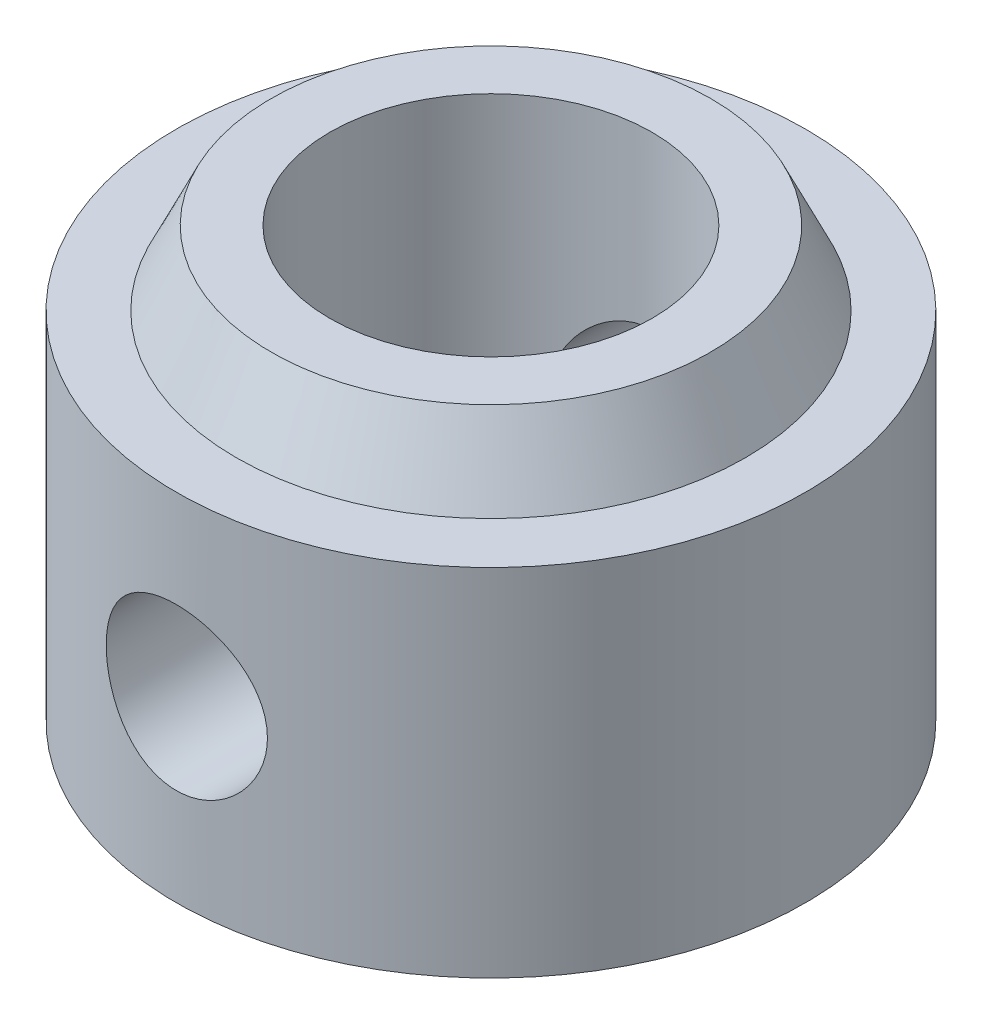
ISO-10303-21;
HEADER;
FILE_DESCRIPTION(('STEP AP214'),'2;1');
FILE_NAME('part.step','',(''),(''),'','','');
FILE_SCHEMA(('AUTOMOTIVE_DESIGN { 1 0 10303 214 1 1 1 1 }'));
ENDSEC;
DATA;
#1=APPLICATION_CONTEXT('core data for automotive mechanical design processes');
#2=APPLICATION_PROTOCOL_DEFINITION('international standard','automotive_design',2000,#1);
#3=PRODUCT_CONTEXT('',#1,'mechanical');
#4=PRODUCT('Part','Part','',(#3));
#5=PRODUCT_RELATED_PRODUCT_CATEGORY('part','',(#4));
#6=PRODUCT_DEFINITION_FORMATION('','',#4);
#7=PRODUCT_DEFINITION_CONTEXT('part definition',#1,'design');
#8=PRODUCT_DEFINITION('design','',#6,#7);
#9=PRODUCT_DEFINITION_SHAPE('','',#8);
#10=(LENGTH_UNIT() NAMED_UNIT(*) SI_UNIT(.MILLI.,.METRE.));
#11=(NAMED_UNIT(*) PLANE_ANGLE_UNIT() SI_UNIT($,.RADIAN.));
#12=(NAMED_UNIT(*) SI_UNIT($,.STERADIAN.) SOLID_ANGLE_UNIT());
#13=UNCERTAINTY_MEASURE_WITH_UNIT(LENGTH_MEASURE(1.E-05),#10,'distance_accuracy_value','');
#14=(GEOMETRIC_REPRESENTATION_CONTEXT(3) GLOBAL_UNCERTAINTY_ASSIGNED_CONTEXT((#13)) GLOBAL_UNIT_ASSIGNED_CONTEXT((#10,
#11,#12)) REPRESENTATION_CONTEXT('',''));
#15=CARTESIAN_POINT('',(0.,0.,0.));
#16=DIRECTION('',(0.,0.,1.));
#17=DIRECTION('',(1.,0.,0.));
#18=AXIS2_PLACEMENT_3D('',#15,#16,#17);
#19=CARTESIAN_POINT('',(2.794,5.461,0.));
#20=DIRECTION('',(0.,1.,0.));
#21=DIRECTION('',(0.,0.,1.));
#22=AXIS2_PLACEMENT_3D('',#19,#20,#21);
#23=PLANE('',#22);
#24=CARTESIAN_POINT('',(0.,5.461,0.));
#25=DIRECTION('',(0.,-1.,0.));
#26=DIRECTION('',(0.,0.,-1.));
#27=AXIS2_PLACEMENT_3D('',#24,#25,#26);
#28=CIRCLE('',#27,2.05);
#29=CARTESIAN_POINT('',(0.,5.461,-2.05));
#30=VERTEX_POINT('',#29);
#31=EDGE_CURVE('E50',#30,#30,#28,.T.);
#32=ORIENTED_EDGE('',*,*,#31,.T.);
#33=EDGE_LOOP('',(#32));
#34=FACE_BOUND('',#33,.T.);
#35=CARTESIAN_POINT('',(0.,5.461,0.));
#36=DIRECTION('',(0.,-1.,0.));
#37=DIRECTION('',(0.,0.,-1.));
#38=AXIS2_PLACEMENT_3D('',#35,#36,#37);
#39=CIRCLE('',#38,2.794);
#40=CARTESIAN_POINT('',(0.,5.461,-2.794));
#41=VERTEX_POINT('',#40);
#42=EDGE_CURVE('E109',#41,#41,#39,.T.);
#43=ORIENTED_EDGE('',*,*,#42,.F.);
#44=EDGE_LOOP('',(#43));
#45=FACE_BOUND('',#44,.T.);
#46=ADVANCED_FACE('F35',(#34,#45),#23,.T.);
#47=CARTESIAN_POINT('',(0.,0.,0.));
#48=DIRECTION('',(0.,-1.,0.));
#49=DIRECTION('',(0.,0.,-1.));
#50=AXIS2_PLACEMENT_3D('',#47,#48,#49);
#51=CYLINDRICAL_SURFACE('',#50,2.05);
#52=CARTESIAN_POINT('',(0.,3.28559999999999,-2.05));
#53=CARTESIAN_POINT('',(-0.0538862620268108,3.2855966151225,-2.04999706239255));
#54=CARTESIAN_POINT('',(-0.107836764690483,3.28132567505028,-2.04785253295006));
#55=CARTESIAN_POINT('',(-0.214143241150135,3.26443079765055,-2.03948509938331));
#56=CARTESIAN_POINT('',(-0.26649598888134,3.2517909971774,-2.03325445024708));
#57=CARTESIAN_POINT('',(-0.367906883502587,3.21877634616778,-2.01736686388394));
#58=CARTESIAN_POINT('',(-0.416976973012657,3.19843155614578,-2.00772325156958));
#59=CARTESIAN_POINT('',(-0.510934432226727,3.15074011310093,-1.98589420928673));
#60=CARTESIAN_POINT('',(-0.555822131339798,3.12339401214492,-1.97370897974368));
#61=CARTESIAN_POINT('',(-0.643195513205963,3.06059481927756,-1.94705164714508));
#62=CARTESIAN_POINT('',(-0.685371591400161,3.02475135877936,-1.93248579105724));
#63=CARTESIAN_POINT('',(-0.763398930988648,2.94681548377178,-1.90301469502913));
#64=CARTESIAN_POINT('',(-0.799245372684431,2.90471835193324,-1.88810920614261));
#65=CARTESIAN_POINT('',(-0.86638330046153,2.81155456673853,-1.85831424977281));
#66=CARTESIAN_POINT('',(-0.897105968940423,2.76004549919543,-1.84351566644385));
#67=CARTESIAN_POINT('',(-0.949322432562957,2.65177348061413,-1.81718128241629));
#68=CARTESIAN_POINT('',(-0.970822820340486,2.59501431805918,-1.80564315297165));
#69=CARTESIAN_POINT('',(-1.0025857532433,2.48131826694253,-1.78819313713754));
#70=CARTESIAN_POINT('',(-1.01344400350745,2.42459543663092,-1.78198578373307));
#71=CARTESIAN_POINT('',(-1.02543766814156,2.30982169127604,-1.77511437197241));
#72=CARTESIAN_POINT('',(-1.02658269058239,2.25177214560707,-1.77444483576871));
#73=CARTESIAN_POINT('',(-1.01955446935159,2.14345682507675,-1.7784870351368));
#74=CARTESIAN_POINT('',(-1.01247917352524,2.09309036799637,-1.78256482753564));
#75=CARTESIAN_POINT('',(-0.991113345283349,1.99438504289263,-1.79453134452197));
#76=CARTESIAN_POINT('',(-0.976820514495086,1.94604682606205,-1.80242128302571));
#77=CARTESIAN_POINT('',(-0.941165024895647,1.8513901391202,-1.8212966332306));
#78=CARTESIAN_POINT('',(-0.919645443793888,1.80514494124457,-1.83234986680599));
#79=CARTESIAN_POINT('',(-0.870267729859696,1.71669985009524,-1.85630989388439));
#80=CARTESIAN_POINT('',(-0.842406749907772,1.67450178600991,-1.86921751899696));
#81=CARTESIAN_POINT('',(-0.777017706285602,1.5897157159382,-1.89740986850868));
#82=CARTESIAN_POINT('',(-0.738711819828507,1.54775670458444,-1.91278847992665));
#83=CARTESIAN_POINT('',(-0.655544468209902,1.47059619594433,-1.94286313882918));
#84=CARTESIAN_POINT('',(-0.610679887988637,1.43539792816527,-1.95755885757771));
#85=CARTESIAN_POINT('',(-0.51302941847764,1.37122219744453,-1.98544536965038));
#86=CARTESIAN_POINT('',(-0.459972431389389,1.34260951574312,-1.99853458766058));
#87=CARTESIAN_POINT('',(-0.348977870876013,1.29495054523092,-2.02086828149273));
#88=CARTESIAN_POINT('',(-0.291044215671905,1.27589666035946,-2.03011580917141));
#89=CARTESIAN_POINT('',(-0.177085653952216,1.24946271119041,-2.04307442084972));
#90=CARTESIAN_POINT('',(-0.12130006881203,1.24124648335956,-2.04718061758844));
#91=CARTESIAN_POINT('',(-0.00899908994808621,1.23409865058715,-2.05074838795579));
#92=CARTESIAN_POINT('',(0.0475159453666497,1.23516264721954,-2.05021216189345));
#93=CARTESIAN_POINT('',(0.155013796285644,1.24606185562923,-2.04478472059777));
#94=CARTESIAN_POINT('',(0.206085893251203,1.25521084604829,-2.04023426830394));
#95=CARTESIAN_POINT('',(0.305867064609464,1.28094402369247,-2.02767725597689));
#96=CARTESIAN_POINT('',(0.354575877833271,1.2975290306147,-2.01967031492691));
#97=CARTESIAN_POINT('',(0.449860823660905,1.33809842809401,-2.00063857699011));
#98=CARTESIAN_POINT('',(0.496336156931306,1.36228082636974,-1.98953403814188));
#99=CARTESIAN_POINT('',(0.584722895741391,1.4171352240372,-1.96537573675037));
#100=CARTESIAN_POINT('',(0.626632345519661,1.44780998795827,-1.9523211445493));
#101=CARTESIAN_POINT('',(0.709061881522916,1.5182544359662,-1.92400926870901));
#102=CARTESIAN_POINT('',(0.749041379770251,1.55862144016491,-1.90866156969653));
#103=CARTESIAN_POINT('',(0.821902729141066,1.64552328005104,-1.87843951393971));
#104=CARTESIAN_POINT('',(0.854779670333107,1.69206234678679,-1.86356549066065));
#105=CARTESIAN_POINT('',(0.914000612360133,1.79283474555533,-1.8352747203172));
#106=CARTESIAN_POINT('',(0.939951133275598,1.84733154786382,-1.82196342905059));
#107=CARTESIAN_POINT('',(0.982034896664141,1.96079781938484,-1.7996342417733));
#108=CARTESIAN_POINT('',(0.998180788784752,2.01976141466372,-1.79061081696634));
#109=CARTESIAN_POINT('',(1.01870822963591,2.13443297843299,-1.77900538533884));
#110=CARTESIAN_POINT('',(1.02407032131088,2.18991010976476,-1.77588818047004));
#111=CARTESIAN_POINT('',(1.0257063832403,2.30103324385,-1.7749448851233));
#112=CARTESIAN_POINT('',(1.02198429279,2.35667916295792,-1.77711650118242));
#113=CARTESIAN_POINT('',(1.00647427873206,2.46097058907032,-1.78593808601276));
#114=CARTESIAN_POINT('',(0.995488522201361,2.50977798189801,-1.79214171844454));
#115=CARTESIAN_POINT('',(0.966754742180253,2.60480332241032,-1.80780291592616));
#116=CARTESIAN_POINT('',(0.949004543438797,2.65102043164427,-1.81726152758918));
#117=CARTESIAN_POINT('',(0.905911138933192,2.74299047226127,-1.83914243623642));
#118=CARTESIAN_POINT('',(0.880137916261861,2.78850359937544,-1.85172115456096));
#119=CARTESIAN_POINT('',(0.822204745927542,2.8748563995851,-1.87816214925455));
#120=CARTESIAN_POINT('',(0.790041475519606,2.91569362378145,-1.89202509139385));
#121=CARTESIAN_POINT('',(0.715658409831249,2.99669553191655,-1.92148881238296));
#122=CARTESIAN_POINT('',(0.672691533585417,3.03617557992097,-1.93709607894256));
#123=CARTESIAN_POINT('',(0.580308676375779,3.10751955800922,-1.96674696061465));
#124=CARTESIAN_POINT('',(0.530889241338197,3.13937938291194,-1.98078973073241));
#125=CARTESIAN_POINT('',(0.426329886740438,3.19461727183125,-2.00590459824731));
#126=CARTESIAN_POINT('',(0.371151991532973,3.21793377364672,-2.01695498976982));
#127=CARTESIAN_POINT('',(0.25701065382654,3.25465337211692,-2.03463874897552));
#128=CARTESIAN_POINT('',(0.198058494613739,3.26808464300031,-2.04128466457255));
#129=CARTESIAN_POINT('',(0.115416995145464,3.27934484635274,-2.04687848457405));
#130=CARTESIAN_POINT('',(0.0924159264254825,3.2816872068852,-2.04804599472682));
#131=CARTESIAN_POINT('',(0.0462805251023348,3.28481553215472,-2.04960739402311));
#132=CARTESIAN_POINT('',(0.023146188838565,3.28560145393297,-2.05000126181357));
#133=CARTESIAN_POINT('',(0.,3.28559999999999,-2.05));
#134=B_SPLINE_CURVE_WITH_KNOTS('',3,(#52,#53,#54,#55,#56,#57,#58,#59,#60,#61,#62,#63,#64,#65,
#66,#67,#68,#69,#70,#71,#72,#73,#74,#75,#76,#77,#78,#79,#80,#81,#82,#83,#84,#85,#86,#87,#88,#89,
#90,#91,#92,#93,#94,#95,#96,#97,#98,#99,#100,#101,#102,#103,#104,#105,#106,#107,#108,#109,#110,
#111,#112,#113,#114,#115,#116,#117,#118,#119,#120,#121,#122,#123,#124,#125,#126,#127,#128,#129,
#130,#131,#132,#133),.UNSPECIFIED.,.T.,.F.,(4,2,2,2,2,2,2,2,2,2,2,2,2,2,2,2,2,2,2,2,2,2,2,2,2,2,
2,2,2,2,2,2,2,2,2,2,2,2,2,2,4),(0.,0.161564863855799,0.323436853451926,0.484683709379603,
0.645917854596104,0.816906302686037,0.988024393595381,1.17241269591521,1.35666896595737,
1.52989462443734,1.70294891262245,1.85530855219552,2.00771674023819,2.16367496172698,
2.31970334291726,2.49551564867224,2.67141172963652,2.855475977698,3.03939372335085,
3.20807872733127,3.37668378624261,3.53222079168773,3.68777494671702,3.84777677428594,
4.00784687017045,4.18363600910527,4.35954628330815,4.54397549213663,4.72816624739294,
4.8946754018583,5.06111236356502,5.21169378500284,5.36232367003266,5.52307368195001,
5.68390750167428,5.86428373821307,6.04475692960983,6.22650614004494,6.40773531340549,
6.47713162141136,6.54652984477713),.UNSPECIFIED.);
#135=CARTESIAN_POINT('',(0.,3.28559999999999,-2.05));
#136=VERTEX_POINT('',#135);
#137=EDGE_CURVE('E81',#136,#136,#134,.T.);
#138=ORIENTED_EDGE('',*,*,#137,.F.);
#139=EDGE_LOOP('',(#138));
#140=FACE_BOUND('',#139,.T.);
#141=CARTESIAN_POINT('',(1.02499999999999,2.2606,1.7753520777581));
#142=CARTESIAN_POINT('',(1.02499627215139,2.20718949659987,1.77535673096671));
#143=CARTESIAN_POINT('',(1.02079747000154,2.15371155318683,1.77779896217451));
#144=CARTESIAN_POINT('',(1.0042162901455,2.04839705370592,1.78721425613354));
#145=CARTESIAN_POINT('',(0.991816716168026,1.99656418708051,1.79419683906949));
#146=CARTESIAN_POINT('',(0.9595024474173,1.89626204404746,1.81168080270534));
#147=CARTESIAN_POINT('',(0.939627701306067,1.84777648121458,1.82216344560084));
#148=CARTESIAN_POINT('',(0.893049213510774,1.75484019295337,1.8454373143728));
#149=CARTESIAN_POINT('',(0.866345102386661,1.71038968598098,1.85822866512967));
#150=CARTESIAN_POINT('',(0.804283204044144,1.62273662822856,1.88596790783878));
#151=CARTESIAN_POINT('',(0.768393337047358,1.57993938593462,1.90100665228903));
#152=CARTESIAN_POINT('',(0.690085152804824,1.50065640188313,1.93081282355349));
#153=CARTESIAN_POINT('',(0.647663598926844,1.4641738083519,1.94558011177031));
#154=CARTESIAN_POINT('',(0.554001802499904,1.39614867007365,1.97437013876773));
#155=CARTESIAN_POINT('',(0.502359868737884,1.36510488794399,1.98827559078627));
#156=CARTESIAN_POINT('',(0.393760952264487,1.3123306254231,2.01259525002017));
#157=CARTESIAN_POINT('',(0.336807351591605,1.29059426745941,2.02301165963335));
#158=CARTESIAN_POINT('',(0.223496067524124,1.25865772216638,2.03852472775343));
#159=CARTESIAN_POINT('',(0.167384335251035,1.24774673548559,2.04394717226414));
#160=CARTESIAN_POINT('',(0.0538848944152927,1.23542972835809,2.05007773442219));
#161=CARTESIAN_POINT('',(-0.00350202098983318,1.2340179567844,2.05078870454205));
#162=CARTESIAN_POINT('',(-0.112578337534344,1.24046534081962,2.04757056464361));
#163=CARTESIAN_POINT('',(-0.164329229156211,1.24752896590926,2.04403958289464));
#164=CARTESIAN_POINT('',(-0.26579661621628,1.26930286500228,2.03333601391241));
#165=CARTESIAN_POINT('',(-0.315512959121273,1.28401371120064,2.02616315418054));
#166=CARTESIAN_POINT('',(-0.412367126358791,1.32075963024207,2.00870872869846));
#167=CARTESIAN_POINT('',(-0.459459759103056,1.34289322100138,1.99838552567429));
#168=CARTESIAN_POINT('',(-0.54937622155116,1.39372000160654,1.97556087136354));
#169=CARTESIAN_POINT('',(-0.59219851505961,1.42241553988492,1.96305864061421));
#170=CARTESIAN_POINT('',(-0.676678002420647,1.48866773532135,1.9356550425921));
#171=CARTESIAN_POINT('',(-0.717842426905091,1.52680560403417,1.9206386039813));
#172=CARTESIAN_POINT('',(-0.793456979555221,1.60930446805344,1.89065699101482));
#173=CARTESIAN_POINT('',(-0.827901941863582,1.65367020658092,1.8756918647227));
#174=CARTESIAN_POINT('',(-0.891242968008262,1.75081439723469,1.84647759994797));
#175=CARTESIAN_POINT('',(-0.919647747852497,1.80394817363057,1.83233427990476));
#176=CARTESIAN_POINT('',(-0.966902090826257,1.91511111314298,1.80784836535541));
#177=CARTESIAN_POINT('',(-0.985761624666156,1.973135093843,1.79750180797219));
#178=CARTESIAN_POINT('',(-1.01185971630066,2.08759487406486,1.78293251712461));
#179=CARTESIAN_POINT('',(-1.01990075017297,2.14379214701964,1.77828947244709));
#180=CARTESIAN_POINT('',(-1.02655487027671,2.25691137505446,1.7744586734565));
#181=CARTESIAN_POINT('',(-1.02517461624789,2.31383278984778,1.77526706561545));
#182=CARTESIAN_POINT('',(-1.01376194442756,2.4201452665432,1.781801949541));
#183=CARTESIAN_POINT('',(-1.00469251213027,2.46967893738563,1.78698077194321));
#184=CARTESIAN_POINT('',(-0.979588691748245,2.56642698092773,1.80086372090125));
#185=CARTESIAN_POINT('',(-0.963552048089197,2.61364059701527,1.8095689890516));
#186=CARTESIAN_POINT('',(-0.924188778320001,2.70689661417526,1.82999627631648));
#187=CARTESIAN_POINT('',(-0.900558915285034,2.75278349227489,1.8418393432414));
#188=CARTESIAN_POINT('',(-0.846944240616192,2.84020600332747,1.86710022484681));
#189=CARTESIAN_POINT('',(-0.816956164440514,2.88173938460111,1.88051884689027));
#190=CARTESIAN_POINT('',(-0.747058096378818,2.96475323671163,1.90945198417745));
#191=CARTESIAN_POINT('',(-0.706373904122834,3.0055670794856,1.92501747733147));
#192=CARTESIAN_POINT('',(-0.618489607783239,3.07999754394343,1.9550259085234));
#193=CARTESIAN_POINT('',(-0.571287311521724,3.1136117344863,1.96946846632902));
#194=CARTESIAN_POINT('',(-0.46999874662272,3.17343806909885,1.99609895733231));
#195=CARTESIAN_POINT('',(-0.41576367501346,3.19943144616618,2.0082173271383));
#196=CARTESIAN_POINT('',(-0.302910423757104,3.24166635145382,2.02830438833284));
#197=CARTESIAN_POINT('',(-0.244296143926976,3.25791644265046,2.03627672268282));
#198=CARTESIAN_POINT('',(-0.130154174388674,3.27880277827902,2.0465919588643));
#199=CARTESIAN_POINT('',(-0.0748367299467154,3.28436782277301,2.04938426105896));
#200=CARTESIAN_POINT('',(0.0360041355999858,3.28646434709075,2.05043183634509));
#201=CARTESIAN_POINT('',(0.0915274778024655,3.28299898923665,2.04868869768562));
#202=CARTESIAN_POINT('',(0.197351442125077,3.26774818303448,2.04112318058871));
#203=CARTESIAN_POINT('',(0.247755125756546,3.25652602951088,2.0355771703469));
#204=CARTESIAN_POINT('',(0.345882100988208,3.22683982571445,2.02121896005009));
#205=CARTESIAN_POINT('',(0.393605007079396,3.2083747369042,2.01240629161116));
#206=CARTESIAN_POINT('',(0.487308991401006,3.16390477152987,1.99184079016823));
#207=CARTESIAN_POINT('',(0.533128271267546,3.13761119371196,1.97997832628769));
#208=CARTESIAN_POINT('',(0.619894007859373,3.07859312086947,1.95455336470372));
#209=CARTESIAN_POINT('',(0.660838212600278,3.04586567215643,1.9409900872232));
#210=CARTESIAN_POINT('',(0.740986854260811,2.97113293250172,1.91191825482293));
#211=CARTESIAN_POINT('',(0.77961262665275,2.92852845033587,1.8963504398699));
#212=CARTESIAN_POINT('',(0.849379869579538,2.83721301084198,1.86614653066924));
#213=CARTESIAN_POINT('',(0.880514718760306,2.78849670861062,1.85151126905912));
#214=CARTESIAN_POINT('',(0.935241856780291,2.68429743725451,1.82449595437539));
#215=CARTESIAN_POINT('',(0.958564692609957,2.62864928059304,1.81220178612677));
#216=CARTESIAN_POINT('',(0.995150677244065,2.51343428555172,1.79237810236561));
#217=CARTESIAN_POINT('',(1.00844747095472,2.45388128886449,1.78483266551395));
#218=CARTESIAN_POINT('',(1.01922618306102,2.3714995104567,1.77867504416836));
#219=CARTESIAN_POINT('',(1.02138800758794,2.34939790824217,1.77743332230281));
#220=CARTESIAN_POINT('',(1.0242757402172,2.3050681073007,1.77577084284944));
#221=CARTESIAN_POINT('',(1.02500155225986,2.28283990020448,1.77535014018238));
#222=CARTESIAN_POINT('',(1.02499999999999,2.2606,1.7753520777581));
#223=B_SPLINE_CURVE_WITH_KNOTS('',3,(#141,#142,#143,#144,#145,#146,#147,#148,#149,#150,#151,
#152,#153,#154,#155,#156,#157,#158,#159,#160,#161,#162,#163,#164,#165,#166,#167,#168,#169,#170,
#171,#172,#173,#174,#175,#176,#177,#178,#179,#180,#181,#182,#183,#184,#185,#186,#187,#188,#189,
#190,#191,#192,#193,#194,#195,#196,#197,#198,#199,#200,#201,#202,#203,#204,#205,#206,#207,#208,
#209,#210,#211,#212,#213,#214,#215,#216,#217,#218,#219,#220,#221,#222),.UNSPECIFIED.,.T.,.F.,(4,
2,2,2,2,2,2,2,2,2,2,2,2,2,2,2,2,2,2,2,2,2,2,2,2,2,2,2,2,2,2,2,2,2,2,2,2,2,2,2,4),(0.,
0.160137925659582,0.320612715145423,0.480241810816855,0.639879543581275,0.812683870310685,
0.985574103614796,1.17011839544732,1.35454597637987,1.52585072092133,1.6970517427819,
1.85336499921651,2.0096899533039,2.16817773099424,2.32672231834027,2.50025371243311,
2.67391799452065,2.85861062772683,3.04310993566995,3.21298848125565,3.3827469551808,
3.53393538009624,3.68517278746962,3.84341478816237,4.00173823375546,4.18001912170126,
4.35836011602654,4.54140785948287,4.72429449303988,4.89040077149221,5.05644888963817,
5.21155535493276,5.3666840684981,5.52844769487455,5.69028575853233,5.86822997896315,
6.04633091416279,6.23006017764566,6.41317011327825,6.47984638564938,6.54652711806899),.UNSPECIFIED.);
#224=CARTESIAN_POINT('',(1.02499999999999,2.2606,1.7753520777581));
#225=VERTEX_POINT('',#224);
#226=EDGE_CURVE('E76',#225,#225,#223,.T.);
#227=ORIENTED_EDGE('',*,*,#226,.F.);
#228=EDGE_LOOP('',(#227));
#229=FACE_BOUND('',#228,.T.);
#230=CARTESIAN_POINT('',(0.,0.,0.));
#231=DIRECTION('',(0.,-1.,0.));
#232=DIRECTION('',(0.,0.,-1.));
#233=AXIS2_PLACEMENT_3D('',#230,#231,#232);
#234=CIRCLE('',#233,2.05);
#235=CARTESIAN_POINT('',(0.,0.,-2.05));
#236=VERTEX_POINT('',#235);
#237=EDGE_CURVE('E54',#236,#236,#234,.T.);
#238=ORIENTED_EDGE('',*,*,#237,.T.);
#239=EDGE_LOOP('',(#238));
#240=FACE_BOUND('',#239,.T.);
#241=ORIENTED_EDGE('',*,*,#31,.F.);
#242=EDGE_LOOP('',(#241));
#243=FACE_BOUND('',#242,.T.);
#244=ADVANCED_FACE('F86',(#140,#229,#240,#243),#51,.F.);
#245=CARTESIAN_POINT('',(2.05,0.,0.));
#246=DIRECTION('',(0.,-1.,0.));
#247=DIRECTION('',(0.,0.,-1.));
#248=AXIS2_PLACEMENT_3D('',#245,#246,#247);
#249=PLANE('',#248);
#250=CARTESIAN_POINT('',(0.,0.,0.));
#251=DIRECTION('',(0.,-1.,0.));
#252=DIRECTION('',(0.,0.,-1.));
#253=AXIS2_PLACEMENT_3D('',#250,#251,#252);
#254=CIRCLE('',#253,4.0005);
#255=CARTESIAN_POINT('',(0.,0.,-4.0005));
#256=VERTEX_POINT('',#255);
#257=EDGE_CURVE('E119',#256,#256,#254,.T.);
#258=ORIENTED_EDGE('',*,*,#257,.T.);
#259=EDGE_LOOP('',(#258));
#260=FACE_BOUND('',#259,.T.);
#261=ORIENTED_EDGE('',*,*,#237,.F.);
#262=EDGE_LOOP('',(#261));
#263=FACE_BOUND('',#262,.T.);
#264=ADVANCED_FACE('F89',(#260,#263),#249,.T.);
#265=CARTESIAN_POINT('',(0.,0.,0.));
#266=DIRECTION('',(0.,-1.,0.));
#267=DIRECTION('',(0.,0.,-1.));
#268=AXIS2_PLACEMENT_3D('',#265,#266,#267);
#269=CYLINDRICAL_SURFACE('',#268,4.0005);
#270=CARTESIAN_POINT('',(0.,3.28559999999999,-4.0005));
#271=CARTESIAN_POINT('',(0.0565856520355311,3.28559849777205,-4.00049907665074));
#272=CARTESIAN_POINT('',(0.113187824681379,3.28089849548102,-3.99928751601397));
#273=CARTESIAN_POINT('',(0.224766894228792,3.26225269364964,-3.99457185317012));
#274=CARTESIAN_POINT('',(0.27974290452061,3.24830194409511,-3.99106652359556));
#275=CARTESIAN_POINT('',(0.38644249190922,3.21163399004599,-3.98215102125961));
#276=CARTESIAN_POINT('',(0.438169989596085,3.18892759863071,-3.97674319876614));
#277=CARTESIAN_POINT('',(0.537082037222003,3.13543170778277,-3.96459702091124));
#278=CARTESIAN_POINT('',(0.584266378294337,3.10464183696316,-3.95785860442061));
#279=CARTESIAN_POINT('',(0.673769466813125,3.03515230170528,-3.94361895772714));
#280=CARTESIAN_POINT('',(0.715976368500867,2.99631108142151,-3.93610548786994));
#281=CARTESIAN_POINT('',(0.793353940988788,2.91212430487071,-3.92124285736807));
#282=CARTESIAN_POINT('',(0.828523777728434,2.86677797868534,-3.91389371629186));
#283=CARTESIAN_POINT('',(0.891361949953948,2.76999087243635,-3.9000677913987));
#284=CARTESIAN_POINT('',(0.918903871040848,2.71846560215945,-3.89360651146785));
#285=CARTESIAN_POINT('',(0.964890978467045,2.61132388915671,-3.88246691727216));
#286=CARTESIAN_POINT('',(0.983337700029715,2.55570813870561,-3.87778830213288));
#287=CARTESIAN_POINT('',(1.01022669536665,2.44319732502387,-3.87086977569368));
#288=CARTESIAN_POINT('',(1.01887069272048,2.38635356197169,-3.86858077192817));
#289=CARTESIAN_POINT('',(1.02653741731668,2.27198018220795,-3.86655378933475));
#290=CARTESIAN_POINT('',(1.02556179410691,2.21445068477419,-3.86681537313852));
#291=CARTESIAN_POINT('',(1.01417762540951,2.10189526053198,-3.86981595078273));
#292=CARTESIAN_POINT('',(1.00401080428216,2.04684292640748,-3.87249145599117));
#293=CARTESIAN_POINT('',(0.97491900866929,1.93925260200016,-3.87991706018316));
#294=CARTESIAN_POINT('',(0.95599338232822,1.88671479917718,-3.88466731357399));
#295=CARTESIAN_POINT('',(0.909718532370253,1.78500335565479,-3.89576455424812));
#296=CARTESIAN_POINT('',(0.882282677942408,1.73587098107854,-3.90212783380235));
#297=CARTESIAN_POINT('',(0.819826705209562,1.64282140484394,-3.9157251097992));
#298=CARTESIAN_POINT('',(0.784805198572286,1.59890516012708,-3.92295926552248));
#299=CARTESIAN_POINT('',(0.706925856302228,1.51615073489325,-3.93774939369166));
#300=CARTESIAN_POINT('',(0.663864395745712,1.47750449410637,-3.9453085088336));
#301=CARTESIAN_POINT('',(0.571780475697047,1.40794437822194,-3.9597014691485));
#302=CARTESIAN_POINT('',(0.522757815690972,1.37703076332991,-3.96653528991061));
#303=CARTESIAN_POINT('',(0.419860664920584,1.32373784814417,-3.97874452966118));
#304=CARTESIAN_POINT('',(0.365968649407784,1.30139102489297,-3.984114376888));
#305=CARTESIAN_POINT('',(0.255024321130355,1.26612841493599,-3.992750215979));
#306=CARTESIAN_POINT('',(0.19797264675609,1.25321073055341,-3.99601663115725));
#307=CARTESIAN_POINT('',(0.0839684367910663,1.23746922637122,-4.00001442218531));
#308=CARTESIAN_POINT('',(0.0270542170308757,1.23438418185035,-4.00081138779299));
#309=CARTESIAN_POINT('',(-0.0864776689434303,1.23767725439246,-3.99996794009198));
#310=CARTESIAN_POINT('',(-0.143095362779339,1.24405447371293,-3.99832775801029));
#311=CARTESIAN_POINT('',(-0.253510277163968,1.26587609532791,-3.99283646479678));
#312=CARTESIAN_POINT('',(-0.307337795550936,1.2811768185167,-3.98902040909669));
#313=CARTESIAN_POINT('',(-0.411658439333348,1.32024600315928,-3.97960841995657));
#314=CARTESIAN_POINT('',(-0.4621512178361,1.34401534391239,-3.97401230169854));
#315=CARTESIAN_POINT('',(-0.559399526306897,1.39984531483197,-3.96150507079384));
#316=CARTESIAN_POINT('',(-0.606068998524409,1.43205071910153,-3.95457161773689));
#317=CARTESIAN_POINT('',(-0.693433574592071,1.50365470100679,-3.94019209400238));
#318=CARTESIAN_POINT('',(-0.734127590301489,1.54305458584604,-3.93274593032109));
#319=CARTESIAN_POINT('',(-0.809471560504464,1.62914439189758,-3.91794217807143));
#320=CARTESIAN_POINT('',(-0.843937860780835,1.67599657610982,-3.91059186780342));
#321=CARTESIAN_POINT('',(-0.904520337582659,1.77497264100638,-3.89702588219254));
#322=CARTESIAN_POINT('',(-0.930636879119626,1.82709629111627,-3.89081015725614));
#323=CARTESIAN_POINT('',(-0.973582573928539,1.93486171479209,-3.88028688582065));
#324=CARTESIAN_POINT('',(-0.990466536916038,1.99048049135351,-3.87596810879017));
#325=CARTESIAN_POINT('',(-1.01460737787969,2.10389566089835,-3.86971969862209));
#326=CARTESIAN_POINT('',(-1.02186648899609,2.16169154555165,-3.86778951129527));
#327=CARTESIAN_POINT('',(-1.02643050385148,2.27594737493201,-3.86658056547745));
#328=CARTESIAN_POINT('',(-1.0240295255589,2.3323949253605,-3.86722346187657));
#329=CARTESIAN_POINT('',(-1.01001799086857,2.44405142804303,-3.87090626775807));
#330=CARTESIAN_POINT('',(-0.998407637939617,2.49926040763393,-3.87394612428282));
#331=CARTESIAN_POINT('',(-0.96647125753609,2.6065343658981,-3.88203556582922));
#332=CARTESIAN_POINT('',(-0.946203018290877,2.65861762440886,-3.88707180992111));
#333=CARTESIAN_POINT('',(-0.897571546702513,2.75868245583385,-3.89858785099527));
#334=CARTESIAN_POINT('',(-0.86920713640441,2.80666343056391,-3.90506785800816));
#335=CARTESIAN_POINT('',(-0.804277673936519,2.89857663791603,-3.91896244761567));
#336=CARTESIAN_POINT('',(-0.767509768144362,2.94236246401581,-3.92639772474921));
#337=CARTESIAN_POINT('',(-0.687208852605598,3.02323835803092,-3.9412445353546));
#338=CARTESIAN_POINT('',(-0.643674225670723,3.06032682074139,-3.94865606271717));
#339=CARTESIAN_POINT('',(-0.55006222236862,3.12745485883959,-3.96279102374742));
#340=CARTESIAN_POINT('',(-0.499874845350383,3.15734467711237,-3.96949842814516));
#341=CARTESIAN_POINT('',(-0.395019205586422,3.20821554889441,-3.98129811383972));
#342=CARTESIAN_POINT('',(-0.34035406329836,3.22920274448214,-3.98639150805527));
#343=CARTESIAN_POINT('',(-0.238186536461553,3.25869473890942,-3.99367058697017));
#344=CARTESIAN_POINT('',(-0.191154498557696,3.26876181802624,-3.99621363758003));
#345=CARTESIAN_POINT('',(-0.0960855549946674,3.28221480803541,-3.99962866650269));
#346=CARTESIAN_POINT('',(-0.0480487333964109,3.28560127559102,-4.00050078404615));
#347=CARTESIAN_POINT('',(0.,3.28559999999999,-4.0005));
#348=B_SPLINE_CURVE_WITH_KNOTS('',3,(#270,#271,#272,#273,#274,#275,#276,#277,#278,#279,#280,
#281,#282,#283,#284,#285,#286,#287,#288,#289,#290,#291,#292,#293,#294,#295,#296,#297,#298,#299,
#300,#301,#302,#303,#304,#305,#306,#307,#308,#309,#310,#311,#312,#313,#314,#315,#316,#317,#318,
#319,#320,#321,#322,#323,#324,#325,#326,#327,#328,#329,#330,#331,#332,#333,#334,#335,#336,#337,
#338,#339,#340,#341,#342,#343,#344,#345,#346,#347),.UNSPECIFIED.,.T.,.F.,(4,2,2,2,2,2,2,2,2,2,2,
2,2,2,2,2,2,2,2,2,2,2,2,2,2,2,2,2,2,2,2,2,2,2,2,2,2,2,4),(0.,0.169580829374382,
0.339252473641572,0.50871524376946,0.678185801048968,0.850936364322594,1.02370739055761,
1.19919035607852,1.3746436908191,1.54641696915123,1.71816079275437,1.88551517966282,
2.05288202357081,2.22201184145331,2.39117263980846,2.56540986708087,2.73965295670698,
2.91455022594671,3.08941228623732,3.25958828234983,3.42974813386286,3.59724102176596,
3.76475130558077,3.9353496906081,4.10597910346527,4.28102394710351,4.45606113757183,
4.63004760592823,4.80399369919943,4.9726843993393,5.1413713725877,5.30894959521507,
5.47655221212774,5.64873329866688,5.82095559845911,5.99649972742941,6.17192254760959,
6.31593119286833,6.45992783807153),.UNSPECIFIED.);
#349=CARTESIAN_POINT('',(0.,3.28559999999999,-4.0005));
#350=VERTEX_POINT('',#349);
#351=EDGE_CURVE('E10',#350,#350,#348,.T.);
#352=ORIENTED_EDGE('',*,*,#351,.F.);
#353=EDGE_LOOP('',(#352));
#354=FACE_BOUND('',#353,.T.);
#355=CARTESIAN_POINT('',(1.02499999999999,2.2606,3.86695943216373));
#356=CARTESIAN_POINT('',(1.02499847839395,2.31715127083633,3.86696048112815));
#357=CARTESIAN_POINT('',(1.02030398935772,2.37371910198535,3.86821351283285));
#358=CARTESIAN_POINT('',(1.00168206772039,2.48522693941926,3.87307665172426));
#359=CARTESIAN_POINT('',(0.987749534848884,2.54016602897127,3.87668806094086));
#360=CARTESIAN_POINT('',(0.951134812067311,2.64678729969593,3.88583269568403));
#361=CARTESIAN_POINT('',(0.92846428458393,2.6984737156361,3.89136335864456));
#362=CARTESIAN_POINT('',(0.875053008903884,2.7973161325729,3.90372011571529));
#363=CARTESIAN_POINT('',(0.844311812846381,2.84447188195351,3.91054628171023));
#364=CARTESIAN_POINT('',(0.774872858088816,2.9340038861901,3.92490152942573));
#365=CARTESIAN_POINT('',(0.736022582149426,2.97626000226275,3.93244229862389));
#366=CARTESIAN_POINT('',(0.651796614338291,3.05373351506768,3.94727589925247));
#367=CARTESIAN_POINT('',(0.606420289369123,3.08895022810859,3.95456870654295));
#368=CARTESIAN_POINT('',(0.509603578634907,3.15184024855808,3.96821439809951));
#369=CARTESIAN_POINT('',(0.458083832980048,3.17939501517956,3.97455188384275));
#370=CARTESIAN_POINT('',(0.350953933207238,3.22540735616127,3.98543925277415));
#371=CARTESIAN_POINT('',(0.295344415547337,3.24386634259569,3.98998941341329));
#372=CARTESIAN_POINT('',(0.182866555410419,3.27077686151273,3.99670682295692));
#373=CARTESIAN_POINT('',(0.126050004224203,3.27943253894234,3.99892261178148));
#374=CARTESIAN_POINT('',(0.011730935680085,3.28713207719075,4.00089097437555));
#375=CARTESIAN_POINT('',(-0.0457714739784088,3.28617742776476,4.00064392992388));
#376=CARTESIAN_POINT('',(-0.158412262668894,3.27482911508599,3.99775038638296));
#377=CARTESIAN_POINT('',(-0.213574506732198,3.26465588106133,3.99515992411245));
#378=CARTESIAN_POINT('',(-0.321381204386072,3.23551415085209,3.98793617876054));
#379=CARTESIAN_POINT('',(-0.374025520102875,3.21654517364737,3.98330278395627));
#380=CARTESIAN_POINT('',(-0.475876108972816,3.17017553196384,3.97242901760515));
#381=CARTESIAN_POINT('',(-0.525045527652815,3.14269749512716,3.96617398929782));
#382=CARTESIAN_POINT('',(-0.618151878718294,3.0801486756477,3.95273380734893));
#383=CARTESIAN_POINT('',(-0.662087857878604,3.04507651306947,3.94554848475828));
#384=CARTESIAN_POINT('',(-0.744795216815933,2.96715752938046,3.93078838877382));
#385=CARTESIAN_POINT('',(-0.783384505933817,2.92411821159882,3.92320835031993));
#386=CARTESIAN_POINT('',(-0.852839781965635,2.83210003915473,3.9086988938273));
#387=CARTESIAN_POINT('',(-0.883705369531312,2.78312087757136,3.90176950944173));
#388=CARTESIAN_POINT('',(-0.936961640048629,2.68024244389734,3.88932622217411));
#389=CARTESIAN_POINT('',(-0.959306427489874,2.62631841530657,3.88382003485198));
#390=CARTESIAN_POINT('',(-0.994555528428629,2.51530358463757,3.87494432977365));
#391=CARTESIAN_POINT('',(-1.00746197826102,2.45821350233393,3.87157432852219));
#392=CARTESIAN_POINT('',(-1.02316162180439,2.34418106452431,3.86745460384323));
#393=CARTESIAN_POINT('',(-1.02622492396692,2.28727838130319,3.86663491705078));
#394=CARTESIAN_POINT('',(-1.02289252521742,2.17377446940428,3.8675178287496));
#395=CARTESIAN_POINT('',(-1.01649774415822,2.11717321194838,3.86922018195804));
#396=CARTESIAN_POINT('',(-0.99466801946537,2.00689557251986,3.87488812104072));
#397=CARTESIAN_POINT('',(-0.979392198272789,1.95318544591683,3.87881383946256));
#398=CARTESIAN_POINT('',(-0.940411350866157,1.84908873526875,3.88844792618008));
#399=CARTESIAN_POINT('',(-0.916705287918982,1.79870256090013,3.89415651371869));
#400=CARTESIAN_POINT('',(-0.860977774251349,1.70154483103367,3.90685907028037));
#401=CARTESIAN_POINT('',(-0.828795885164658,1.65486850003917,3.91387698133982));
#402=CARTESIAN_POINT('',(-0.757231639726001,1.56747943346306,3.92834959597639));
#403=CARTESIAN_POINT('',(-0.717848037807719,1.52676773168631,3.93580437495984));
#404=CARTESIAN_POINT('',(-0.631755114100395,1.45135951737975,3.95054924594735));
#405=CARTESIAN_POINT('',(-0.584879691695897,1.41685041443465,3.95782977851683));
#406=CARTESIAN_POINT('',(-0.485843185130069,1.35619269297201,3.9712025408858));
#407=CARTESIAN_POINT('',(-0.433682379922384,1.33004363352774,3.97729483334903));
#408=CARTESIAN_POINT('',(-0.325919869389815,1.28708057451739,3.9875658452208));
#409=CARTESIAN_POINT('',(-0.270346767524422,1.27019832384052,3.9917585144503));
#410=CARTESIAN_POINT('',(-0.157030013038701,1.24604554495266,3.99781907696929));
#411=CARTESIAN_POINT('',(-0.0992868043537557,1.23877306177542,3.99968744309962));
#412=CARTESIAN_POINT('',(0.0149740630673891,1.23416083645734,4.00086847351959));
#413=CARTESIAN_POINT('',(0.0714800134798809,1.23654514575426,4.00025214187813));
#414=CARTESIAN_POINT('',(0.183257874548349,1.250543596616,3.99669162486758));
#415=CARTESIAN_POINT('',(0.238529825277387,1.26215743801031,3.99374751520444));
#416=CARTESIAN_POINT('',(0.34596604543745,1.29413424936469,3.98587438339588));
#417=CARTESIAN_POINT('',(0.398146758470787,1.31444507826315,3.98095720129344));
#418=CARTESIAN_POINT('',(0.498389385738841,1.36319235366074,3.96965434396504));
#419=CARTESIAN_POINT('',(0.546450757335519,1.39162986855073,3.9632684756769));
#420=CARTESIAN_POINT('',(0.638390273434719,1.45665242307099,3.94951574756745));
#421=CARTESIAN_POINT('',(0.682134027896711,1.49342314344005,3.94212837714515));
#422=CARTESIAN_POINT('',(0.762923801829469,1.57371087830743,3.92729402038276));
#423=CARTESIAN_POINT('',(0.799968098041454,1.6172296232253,3.91984701921719));
#424=CARTESIAN_POINT('',(0.867031894086367,1.71081812267651,3.90556751293444));
#425=CARTESIAN_POINT('',(0.896897297547199,1.76100080024328,3.8987501460506));
#426=CARTESIAN_POINT('',(0.947723714879953,1.86584282426492,3.88670901388025));
#427=CARTESIAN_POINT('',(0.968690971119614,1.92049900018482,3.88148413213615));
#428=CARTESIAN_POINT('',(0.998141301465995,2.0226181495902,3.8740030647801));
#429=CARTESIAN_POINT('',(1.00819075018381,2.0696086696797,3.87138211721182));
#430=CARTESIAN_POINT('',(1.02162042814593,2.16459554565842,3.86785993743997));
#431=CARTESIAN_POINT('',(1.02500129174035,2.2125918054375,3.86695854166405));
#432=CARTESIAN_POINT('',(1.02499999999999,2.2606,3.86695943216373));
#433=B_SPLINE_CURVE_WITH_KNOTS('',3,(#355,#356,#357,#358,#359,#360,#361,#362,#363,#364,#365,
#366,#367,#368,#369,#370,#371,#372,#373,#374,#375,#376,#377,#378,#379,#380,#381,#382,#383,#384,
#385,#386,#387,#388,#389,#390,#391,#392,#393,#394,#395,#396,#397,#398,#399,#400,#401,#402,#403,
#404,#405,#406,#407,#408,#409,#410,#411,#412,#413,#414,#415,#416,#417,#418,#419,#420,#421,#422,
#423,#424,#425,#426,#427,#428,#429,#430,#431,#432),.UNSPECIFIED.,.T.,.F.,(4,2,2,2,2,2,2,2,2,2,2,
2,2,2,2,2,2,2,2,2,2,2,2,2,2,2,2,2,2,2,2,2,2,2,2,2,2,2,4),(0.,0.169477427969048,
0.339048501438738,0.508394031146705,0.677748960233033,0.850634604617422,1.02353703210858,
1.19898198677352,1.37439969590265,1.54609316529554,1.7177600198497,1.88542736367478,
2.05310387794541,2.22235220350769,2.39163130918389,2.56571747811861,2.73981264619054,
2.91483272393036,3.08981317421258,3.25994900730471,3.43006829479926,3.59722957236903,
3.76441141418867,3.93501901288262,4.10565614683021,4.28080299419158,4.45594060240596,
4.62977037609765,4.8035647812245,4.97242845638943,5.1412866398542,5.30914633821954,
5.47702811475256,5.64910109725916,5.82121827823967,5.99675315782637,6.17216468904662,
6.31605322229671,6.45992806746929),.UNSPECIFIED.);
#434=CARTESIAN_POINT('',(1.02499999999999,2.2606,3.86695943216373));
#435=VERTEX_POINT('',#434);
#436=EDGE_CURVE('E46',#435,#435,#433,.T.);
#437=ORIENTED_EDGE('',*,*,#436,.F.);
#438=EDGE_LOOP('',(#437));
#439=FACE_BOUND('',#438,.T.);
#440=CARTESIAN_POINT('',(0.,4.5212,0.));
#441=DIRECTION('',(0.,-1.,0.));
#442=DIRECTION('',(0.,0.,-1.));
#443=AXIS2_PLACEMENT_3D('',#440,#441,#442);
#444=CIRCLE('',#443,4.0005);
#445=CARTESIAN_POINT('',(0.,4.5212,-4.0005));
#446=VERTEX_POINT('',#445);
#447=EDGE_CURVE('E113',#446,#446,#444,.T.);
#448=ORIENTED_EDGE('',*,*,#447,.T.);
#449=EDGE_LOOP('',(#448));
#450=FACE_BOUND('',#449,.T.);
#451=ORIENTED_EDGE('',*,*,#257,.F.);
#452=EDGE_LOOP('',(#451));
#453=FACE_BOUND('',#452,.T.);
#454=ADVANCED_FACE('F60',(#354,#439,#450,#453),#269,.T.);
#455=CARTESIAN_POINT('',(4.0005,4.5212,0.));
#456=DIRECTION('',(0.,1.,0.));
#457=DIRECTION('',(0.,0.,1.));
#458=AXIS2_PLACEMENT_3D('',#455,#456,#457);
#459=PLANE('',#458);
#460=CARTESIAN_POINT('',(0.,4.5212,0.));
#461=DIRECTION('',(0.,-1.,0.));
#462=DIRECTION('',(0.,0.,-1.));
#463=AXIS2_PLACEMENT_3D('',#460,#461,#462);
#464=CIRCLE('',#463,3.2385);
#465=CARTESIAN_POINT('',(0.,4.5212,-3.2385));
#466=VERTEX_POINT('',#465);
#467=EDGE_CURVE('E111',#466,#466,#464,.T.);
#468=ORIENTED_EDGE('',*,*,#467,.T.);
#469=EDGE_LOOP('',(#468));
#470=FACE_BOUND('',#469,.T.);
#471=ORIENTED_EDGE('',*,*,#447,.F.);
#472=EDGE_LOOP('',(#471));
#473=FACE_BOUND('',#472,.T.);
#474=ADVANCED_FACE('F97',(#470,#473),#459,.T.);
#475=CARTESIAN_POINT('',(0.,4.5212,0.));
#476=DIRECTION('',(0.,-1.,0.));
#477=DIRECTION('',(0.,0.,-1.));
#478=AXIS2_PLACEMENT_3D('',#475,#476,#477);
#479=CONICAL_SURFACE('',#478,3.2385,0.441793165517444);
#480=ORIENTED_EDGE('',*,*,#42,.T.);
#481=EDGE_LOOP('',(#480));
#482=FACE_BOUND('',#481,.T.);
#483=ORIENTED_EDGE('',*,*,#467,.F.);
#484=EDGE_LOOP('',(#483));
#485=FACE_BOUND('',#484,.T.);
#486=ADVANCED_FACE('F69',(#482,#485),#479,.T.);
#487=CARTESIAN_POINT('',(0.,2.2606,4.0005));
#488=DIRECTION('',(0.,0.,1.));
#489=DIRECTION('',(1.,0.,0.));
#490=AXIS2_PLACEMENT_3D('',#487,#488,#489);
#491=CYLINDRICAL_SURFACE('',#490,1.02499999999999);
#492=ORIENTED_EDGE('',*,*,#226,.T.);
#493=EDGE_LOOP('',(#492));
#494=FACE_BOUND('',#493,.T.);
#495=ORIENTED_EDGE('',*,*,#436,.T.);
#496=EDGE_LOOP('',(#495));
#497=FACE_BOUND('',#496,.T.);
#498=ADVANCED_FACE('F64',(#494,#497),#491,.F.);
#499=ORIENTED_EDGE('',*,*,#137,.T.);
#500=EDGE_LOOP('',(#499));
#501=FACE_BOUND('',#500,.T.);
#502=ORIENTED_EDGE('',*,*,#351,.T.);
#503=EDGE_LOOP('',(#502));
#504=FACE_BOUND('',#503,.T.);
#505=ADVANCED_FACE('F68',(#501,#504),#491,.F.);
#506=CLOSED_SHELL('',(#46,#244,#264,#454,#474,#486,#498,#505));
#507=MANIFOLD_SOLID_BREP('B2',#506);
#508=ADVANCED_BREP_SHAPE_REPRESENTATION('',(#18,#507),#14);
#509=SHAPE_DEFINITION_REPRESENTATION(#9,#508);
ENDSEC;
END-ISO-10303-21;
